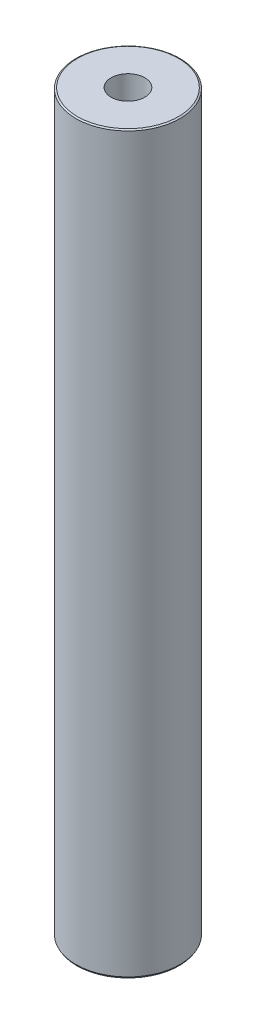
ISO-10303-21;
HEADER;
FILE_DESCRIPTION(('STEP AP214'),'2;1');
FILE_NAME('part.step','',(''),(''),'','','');
FILE_SCHEMA(('AUTOMOTIVE_DESIGN { 1 0 10303 214 1 1 1 1 }'));
ENDSEC;
DATA;
#1=APPLICATION_CONTEXT('core data for automotive mechanical design processes');
#2=APPLICATION_PROTOCOL_DEFINITION('international standard','automotive_design',2000,#1);
#3=PRODUCT_CONTEXT('',#1,'mechanical');
#4=PRODUCT('Part','Part','',(#3));
#5=PRODUCT_RELATED_PRODUCT_CATEGORY('part','',(#4));
#6=PRODUCT_DEFINITION_FORMATION('','',#4);
#7=PRODUCT_DEFINITION_CONTEXT('part definition',#1,'design');
#8=PRODUCT_DEFINITION('design','',#6,#7);
#9=PRODUCT_DEFINITION_SHAPE('','',#8);
#10=(LENGTH_UNIT() NAMED_UNIT(*) SI_UNIT(.MILLI.,.METRE.));
#11=(NAMED_UNIT(*) PLANE_ANGLE_UNIT() SI_UNIT($,.RADIAN.));
#12=(NAMED_UNIT(*) SI_UNIT($,.STERADIAN.) SOLID_ANGLE_UNIT());
#13=UNCERTAINTY_MEASURE_WITH_UNIT(LENGTH_MEASURE(1.E-05),#10,'distance_accuracy_value','');
#14=(GEOMETRIC_REPRESENTATION_CONTEXT(3) GLOBAL_UNCERTAINTY_ASSIGNED_CONTEXT((#13)) GLOBAL_UNIT_ASSIGNED_CONTEXT((#10,
#11,#12)) REPRESENTATION_CONTEXT('',''));
#15=CARTESIAN_POINT('',(0.,0.,0.));
#16=DIRECTION('',(0.,0.,1.));
#17=DIRECTION('',(1.,0.,0.));
#18=AXIS2_PLACEMENT_3D('',#15,#16,#17);
#19=CARTESIAN_POINT('',(0.,600.,0.));
#20=DIRECTION('',(0.,-1.,0.));
#21=DIRECTION('',(0.,0.,-1.));
#22=AXIS2_PLACEMENT_3D('',#19,#20,#21);
#23=CYLINDRICAL_SURFACE('',#22,42.5);
#24=CARTESIAN_POINT('',(0.,599.259265410119,0.));
#25=DIRECTION('',(0.,1.,0.));
#26=DIRECTION('',(0.,0.,1.));
#27=AXIS2_PLACEMENT_3D('',#24,#25,#26);
#28=CIRCLE('',#27,42.5);
#29=CARTESIAN_POINT('',(0.,599.259265410119,42.5));
#30=VERTEX_POINT('',#29);
#31=EDGE_CURVE('E50',#30,#30,#28,.F.);
#32=ORIENTED_EDGE('',*,*,#31,.T.);
#33=EDGE_LOOP('',(#32));
#34=FACE_BOUND('',#33,.T.);
#35=CARTESIAN_POINT('',(0.,1.28298994459819,0.));
#36=DIRECTION('',(0.,1.,0.));
#37=DIRECTION('',(0.,0.,1.));
#38=AXIS2_PLACEMENT_3D('',#35,#36,#37);
#39=CIRCLE('',#38,42.5);
#40=CARTESIAN_POINT('',(0.,1.28298994459819,42.5));
#41=VERTEX_POINT('',#40);
#42=EDGE_CURVE('E51',#41,#41,#39,.T.);
#43=ORIENTED_EDGE('',*,*,#42,.T.);
#44=EDGE_LOOP('',(#43));
#45=FACE_BOUND('',#44,.T.);
#46=ADVANCED_FACE('F39',(#34,#45),#23,.T.);
#47=CARTESIAN_POINT('',(0.,600.,0.));
#48=DIRECTION('',(0.,1.,0.));
#49=DIRECTION('',(0.,0.,1.));
#50=AXIS2_PLACEMENT_3D('',#47,#48,#49);
#51=PLANE('',#50);
#52=CARTESIAN_POINT('',(0.,600.,0.));
#53=DIRECTION('',(0.,1.,0.));
#54=DIRECTION('',(0.,0.,1.));
#55=AXIS2_PLACEMENT_3D('',#52,#53,#54);
#56=CIRCLE('',#55,41.2170100554019);
#57=CARTESIAN_POINT('',(0.,600.,41.2170100554019));
#58=VERTEX_POINT('',#57);
#59=EDGE_CURVE('E54',#58,#58,#56,.T.);
#60=ORIENTED_EDGE('',*,*,#59,.T.);
#61=EDGE_LOOP('',(#60));
#62=FACE_BOUND('',#61,.T.);
#63=CARTESIAN_POINT('',(0.,600.,0.));
#64=DIRECTION('',(0.,1.,0.));
#65=DIRECTION('',(0.,0.,1.));
#66=AXIS2_PLACEMENT_3D('',#63,#64,#65);
#67=CIRCLE('',#66,13.7813393877205);
#68=CARTESIAN_POINT('',(0.,600.,13.7813393877205));
#69=VERTEX_POINT('',#68);
#70=EDGE_CURVE('E58',#69,#69,#67,.T.);
#71=ORIENTED_EDGE('',*,*,#70,.F.);
#72=EDGE_LOOP('',(#71));
#73=FACE_BOUND('',#72,.T.);
#74=ADVANCED_FACE('F69',(#62,#73),#51,.T.);
#75=CARTESIAN_POINT('',(0.,0.,0.));
#76=DIRECTION('',(0.,1.,0.));
#77=DIRECTION('',(0.,0.,1.));
#78=AXIS2_PLACEMENT_3D('',#75,#76,#77);
#79=PLANE('',#78);
#80=CARTESIAN_POINT('',(0.,0.,0.));
#81=DIRECTION('',(0.,1.,0.));
#82=DIRECTION('',(0.,0.,1.));
#83=AXIS2_PLACEMENT_3D('',#80,#81,#82);
#84=CIRCLE('',#83,41.7592654101186);
#85=CARTESIAN_POINT('',(0.,0.,41.7592654101186));
#86=VERTEX_POINT('',#85);
#87=EDGE_CURVE('E10',#86,#86,#84,.F.);
#88=ORIENTED_EDGE('',*,*,#87,.T.);
#89=EDGE_LOOP('',(#88));
#90=FACE_BOUND('',#89,.T.);
#91=CARTESIAN_POINT('',(0.,0.,0.));
#92=DIRECTION('',(0.,1.,0.));
#93=DIRECTION('',(0.,0.,1.));
#94=AXIS2_PLACEMENT_3D('',#91,#92,#93);
#95=CIRCLE('',#94,13.7813393877205);
#96=CARTESIAN_POINT('',(0.,0.,13.7813393877205));
#97=VERTEX_POINT('',#96);
#98=EDGE_CURVE('E63',#97,#97,#95,.T.);
#99=ORIENTED_EDGE('',*,*,#98,.T.);
#100=EDGE_LOOP('',(#99));
#101=FACE_BOUND('',#100,.T.);
#102=ADVANCED_FACE('F75',(#90,#101),#79,.F.);
#103=CARTESIAN_POINT('',(0.,600.,0.));
#104=DIRECTION('',(0.,-1.,0.));
#105=DIRECTION('',(0.,0.,-1.));
#106=AXIS2_PLACEMENT_3D('',#103,#104,#105);
#107=CYLINDRICAL_SURFACE('',#106,13.7813393877205);
#108=ORIENTED_EDGE('',*,*,#70,.T.);
#109=EDGE_LOOP('',(#108));
#110=FACE_BOUND('',#109,.T.);
#111=ORIENTED_EDGE('',*,*,#98,.F.);
#112=EDGE_LOOP('',(#111));
#113=FACE_BOUND('',#112,.T.);
#114=ADVANCED_FACE('F70',(#110,#113),#107,.F.);
#115=CARTESIAN_POINT('',(0.,600.,0.));
#116=DIRECTION('',(0.,-1.,0.));
#117=DIRECTION('',(0.,0.,-1.));
#118=AXIS2_PLACEMENT_3D('',#115,#116,#117);
#119=CONICAL_SURFACE('',#118,41.2170100554019,1.04719755119658);
#120=ORIENTED_EDGE('',*,*,#31,.F.);
#121=EDGE_LOOP('',(#120));
#122=FACE_BOUND('',#121,.T.);
#123=ORIENTED_EDGE('',*,*,#59,.F.);
#124=EDGE_LOOP('',(#123));
#125=FACE_BOUND('',#124,.T.);
#126=ADVANCED_FACE('F81',(#122,#125),#119,.T.);
#127=CARTESIAN_POINT('',(0.,1.28298994459819,0.));
#128=DIRECTION('',(0.,1.,0.));
#129=DIRECTION('',(0.,0.,1.));
#130=AXIS2_PLACEMENT_3D('',#127,#128,#129);
#131=CONICAL_SURFACE('',#130,42.5,0.523598775598338);
#132=ORIENTED_EDGE('',*,*,#87,.F.);
#133=EDGE_LOOP('',(#132));
#134=FACE_BOUND('',#133,.T.);
#135=ORIENTED_EDGE('',*,*,#42,.F.);
#136=EDGE_LOOP('',(#135));
#137=FACE_BOUND('',#136,.T.);
#138=ADVANCED_FACE('F45',(#134,#137),#131,.T.);
#139=CLOSED_SHELL('',(#46,#74,#102,#114,#126,#138));
#140=MANIFOLD_SOLID_BREP('B2',#139);
#141=ADVANCED_BREP_SHAPE_REPRESENTATION('',(#18,#140),#14);
#142=SHAPE_DEFINITION_REPRESENTATION(#9,#141);
ENDSEC;
END-ISO-10303-21;
